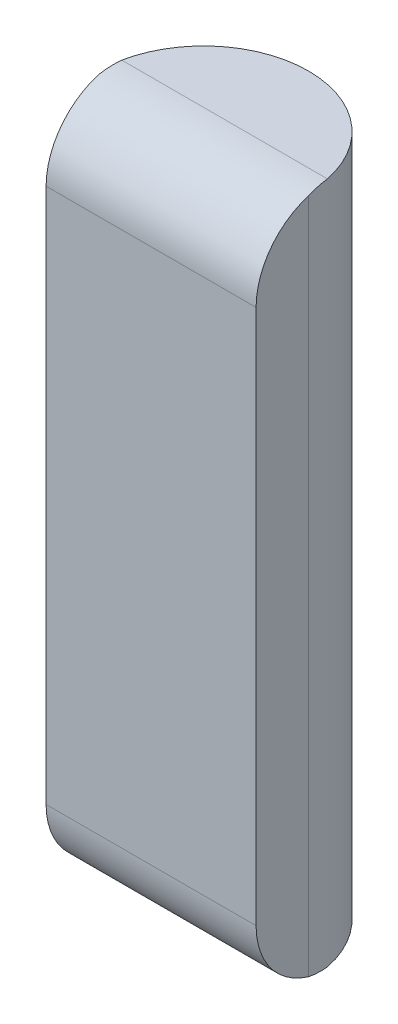
ISO-10303-21;
HEADER;
FILE_DESCRIPTION(('STEP AP214'),'2;1');
FILE_NAME('part.step','',(''),(''),'','','');
FILE_SCHEMA(('AUTOMOTIVE_DESIGN { 1 0 10303 214 1 1 1 1 }'));
ENDSEC;
DATA;
#1=APPLICATION_CONTEXT('core data for automotive mechanical design processes');
#2=APPLICATION_PROTOCOL_DEFINITION('international standard','automotive_design',2000,#1);
#3=PRODUCT_CONTEXT('',#1,'mechanical');
#4=PRODUCT('Part','Part','',(#3));
#5=PRODUCT_RELATED_PRODUCT_CATEGORY('part','',(#4));
#6=PRODUCT_DEFINITION_FORMATION('','',#4);
#7=PRODUCT_DEFINITION_CONTEXT('part definition',#1,'design');
#8=PRODUCT_DEFINITION('design','',#6,#7);
#9=PRODUCT_DEFINITION_SHAPE('','',#8);
#10=(LENGTH_UNIT() NAMED_UNIT(*) SI_UNIT(.MILLI.,.METRE.));
#11=(NAMED_UNIT(*) PLANE_ANGLE_UNIT() SI_UNIT($,.RADIAN.));
#12=(NAMED_UNIT(*) SI_UNIT($,.STERADIAN.) SOLID_ANGLE_UNIT());
#13=UNCERTAINTY_MEASURE_WITH_UNIT(LENGTH_MEASURE(1.E-05),#10,'distance_accuracy_value','');
#14=(GEOMETRIC_REPRESENTATION_CONTEXT(3) GLOBAL_UNCERTAINTY_ASSIGNED_CONTEXT((#13)) GLOBAL_UNIT_ASSIGNED_CONTEXT((#10,
#11,#12)) REPRESENTATION_CONTEXT('',''));
#15=CARTESIAN_POINT('',(0.,0.,0.));
#16=DIRECTION('',(0.,0.,1.));
#17=DIRECTION('',(1.,0.,0.));
#18=AXIS2_PLACEMENT_3D('',#15,#16,#17);
#19=CARTESIAN_POINT('',(0.6,0.,0.35));
#20=DIRECTION('',(0.,1.,0.));
#21=DIRECTION('',(0.,0.,-1.));
#22=AXIS2_PLACEMENT_3D('',#19,#20,#21);
#23=CYLINDRICAL_SURFACE('',#22,0.1);
#24=CARTESIAN_POINT('',(0.700000000000001,0.647082039324995,0.349999999999997));
#25=CARTESIAN_POINT('',(0.699915816237973,0.647323506050398,0.349190121189793));
#26=CARTESIAN_POINT('',(0.699831632475945,0.647550292569989,0.348375866058584));
#27=CARTESIAN_POINT('',(0.699663264951889,0.647974238368766,0.34673967912913));
#28=CARTESIAN_POINT('',(0.699579081189861,0.648171397647952,0.345917747330885));
#29=CARTESIAN_POINT('',(0.699410713665805,0.648535822137135,0.344267283042332));
#30=CARTESIAN_POINT('',(0.699326529903777,0.648703087347132,0.343438750552023));
#31=CARTESIAN_POINT('',(0.699158162379721,0.649007506544538,0.341776172212152));
#32=CARTESIAN_POINT('',(0.699073978617693,0.649144660531946,0.340942126362589));
#33=CARTESIAN_POINT('',(0.698905611093636,0.649388676630988,0.339269615138349));
#34=CARTESIAN_POINT('',(0.698821427331608,0.649495538742622,0.338431149763672));
#35=CARTESIAN_POINT('',(0.698653059807552,0.649678831688704,0.336750899341898));
#36=CARTESIAN_POINT('',(0.698568876045524,0.649755262523153,0.3359091142948));
#37=CARTESIAN_POINT('',(0.698400508521468,0.649877590349677,0.334223328579187));
#38=CARTESIAN_POINT('',(0.69831632475944,0.649923487341753,0.333379327910672));
#39=CARTESIAN_POINT('',(0.698147957235384,0.649984695768093,0.331690218311812));
#40=CARTESIAN_POINT('',(0.698063773473356,0.650000007202358,0.330845109381467));
#41=CARTESIAN_POINT('',(0.697979589711328,0.65,0.33));
#42=B_SPLINE_CURVE_WITH_KNOTS('',3,(#24,#25,#26,#27,#28,#29,#30,#31,#32,#33,#34,#35,#36,#37,#38,
#39,#40,#41),.UNSPECIFIED.,.F.,.F.,(4,2,2,2,2,2,2,2,4),(0.,0.0025477371259426,
0.0050954742518852,0.00764321137782769,0.0101909485037703,0.0127386856297129,0.0152864227556555,
0.0178341598815981,0.0203818970075407),.UNSPECIFIED.);
#43=CARTESIAN_POINT('',(0.700000000000001,0.647082039324994,0.35));
#44=VERTEX_POINT('',#43);
#45=CARTESIAN_POINT('',(0.697979589711328,0.65,0.33));
#46=VERTEX_POINT('',#45);
#47=EDGE_CURVE('E11',#44,#46,#42,.T.);
#48=ORIENTED_EDGE('',*,*,#47,.F.);
#49=DIRECTION('',(0.,1.,0.));
#50=VECTOR('',#49,1.);
#51=CARTESIAN_POINT('',(0.700000000000001,0.,0.35));
#52=LINE('',#51,#50);
#53=CARTESIAN_POINT('',(0.700000000000001,0.00291796067500627,0.35));
#54=VERTEX_POINT('',#53);
#55=EDGE_CURVE('E25',#54,#44,#52,.T.);
#56=ORIENTED_EDGE('',*,*,#55,.F.);
#57=CARTESIAN_POINT('',(0.697979589711328,0.,0.33));
#58=CARTESIAN_POINT('',(0.698063773473356,-7.20235840353421E-09,0.330845109381467));
#59=CARTESIAN_POINT('',(0.698147957235384,1.53042319068309E-05,0.331690218311812));
#60=CARTESIAN_POINT('',(0.69831632475944,7.65126582475088E-05,0.333379327910672));
#61=CARTESIAN_POINT('',(0.698400508521468,0.000122409650322953,0.334223328579187));
#62=CARTESIAN_POINT('',(0.698568876045524,0.000244737476846982,0.3359091142948));
#63=CARTESIAN_POINT('',(0.698653059807552,0.000321168311295568,0.336750899341898));
#64=CARTESIAN_POINT('',(0.698821427331608,0.000504461257378027,0.338431149763672));
#65=CARTESIAN_POINT('',(0.698905611093636,0.000611323369011901,0.339269615138349));
#66=CARTESIAN_POINT('',(0.699073978617693,0.000855339468053784,0.340942126362589));
#67=CARTESIAN_POINT('',(0.699158162379721,0.000992493455461792,0.341776172212152));
#68=CARTESIAN_POINT('',(0.699326529903777,0.00129691265286743,0.343438750552023));
#69=CARTESIAN_POINT('',(0.699410713665805,0.00146417786286507,0.344267283042332));
#70=CARTESIAN_POINT('',(0.699579081189861,0.00182860235204831,0.345917747330885));
#71=CARTESIAN_POINT('',(0.699663264951889,0.0020257616312339,0.34673967912913));
#72=CARTESIAN_POINT('',(0.699831632475945,0.00244970743001087,0.348375866058584));
#73=CARTESIAN_POINT('',(0.699915816237973,0.00267649394960225,0.349190121189793));
#74=CARTESIAN_POINT('',(0.700000000000001,0.00291796067500541,0.349999999999997));
#75=B_SPLINE_CURVE_WITH_KNOTS('',3,(#57,#58,#59,#60,#61,#62,#63,#64,#65,#66,#67,#68,#69,#70,#71,
#72,#73,#74),.UNSPECIFIED.,.F.,.F.,(4,2,2,2,2,2,2,2,4),(0.,0.00254773712594261,
0.00509547425188525,0.00764321137782786,0.0101909485037705,0.012738685629713,0.0152864227556557,
0.0178341598815982,0.0203818970075408),.UNSPECIFIED.);
#76=CARTESIAN_POINT('',(0.697979589711328,0.,0.33));
#77=VERTEX_POINT('',#76);
#78=EDGE_CURVE('E171',#77,#54,#75,.T.);
#79=ORIENTED_EDGE('',*,*,#78,.F.);
#80=CARTESIAN_POINT('',(0.6,0.,0.35));
#81=DIRECTION('',(0.,1.,0.));
#82=DIRECTION('',(0.,0.,1.));
#83=AXIS2_PLACEMENT_3D('',#80,#81,#82);
#84=CIRCLE('',#83,0.1);
#85=CARTESIAN_POINT('',(0.502020410288673,0.,0.33));
#86=VERTEX_POINT('',#85);
#87=EDGE_CURVE('E206',#77,#86,#84,.T.);
#88=ORIENTED_EDGE('',*,*,#87,.T.);
#89=CARTESIAN_POINT('',(0.5,0.00291796067500539,0.349999999999997));
#90=CARTESIAN_POINT('',(0.500084183762028,0.00267649394960223,0.349190121189793));
#91=CARTESIAN_POINT('',(0.500168367524056,0.00244970743001086,0.348375866058584));
#92=CARTESIAN_POINT('',(0.500336735048112,0.00202576163123388,0.34673967912913));
#93=CARTESIAN_POINT('',(0.50042091881014,0.00182860235204828,0.345917747330885));
#94=CARTESIAN_POINT('',(0.500589286334196,0.00146417786286505,0.344267283042332));
#95=CARTESIAN_POINT('',(0.500673470096224,0.00129691265286742,0.343438750552023));
#96=CARTESIAN_POINT('',(0.50084183762028,0.000992493455461778,0.341776172212152));
#97=CARTESIAN_POINT('',(0.500926021382308,0.000855339468053773,0.340942126362589));
#98=CARTESIAN_POINT('',(0.501094388906365,0.000611323369011889,0.339269615138349));
#99=CARTESIAN_POINT('',(0.501178572668392,0.00050446125737801,0.338431149763672));
#100=CARTESIAN_POINT('',(0.501346940192449,0.000321168311295555,0.336750899341898));
#101=CARTESIAN_POINT('',(0.501431123954477,0.000244737476846979,0.3359091142948));
#102=CARTESIAN_POINT('',(0.501599491478533,0.000122409650322957,0.334223328579187));
#103=CARTESIAN_POINT('',(0.501683675240561,7.6512658247511E-05,0.333379327910672));
#104=CARTESIAN_POINT('',(0.501852042764617,1.5304231906828E-05,0.331690218311812));
#105=CARTESIAN_POINT('',(0.501936226526645,-7.20235840859029E-09,0.330845109381467));
#106=CARTESIAN_POINT('',(0.502020410288673,0.,0.33));
#107=B_SPLINE_CURVE_WITH_KNOTS('',3,(#89,#90,#91,#92,#93,#94,#95,#96,#97,#98,#99,#100,#101,#102,
#103,#104,#105,#106),.UNSPECIFIED.,.F.,.F.,(4,2,2,2,2,2,2,2,4),(0.,0.00254773712594259,
0.00509547425188521,0.00764321137782782,0.0101909485037704,0.012738685629713,0.0152864227556556,
0.0178341598815982,0.0203818970075408),.UNSPECIFIED.);
#108=CARTESIAN_POINT('',(0.5,0.00291796067500622,0.35));
#109=VERTEX_POINT('',#108);
#110=EDGE_CURVE('E203',#109,#86,#107,.T.);
#111=ORIENTED_EDGE('',*,*,#110,.F.);
#112=DIRECTION('',(0.,1.,0.));
#113=VECTOR('',#112,1.);
#114=CARTESIAN_POINT('',(0.5,0.,0.35));
#115=LINE('',#114,#113);
#116=CARTESIAN_POINT('',(0.5,0.647082039324994,0.35));
#117=VERTEX_POINT('',#116);
#118=EDGE_CURVE('E75',#109,#117,#115,.T.);
#119=ORIENTED_EDGE('',*,*,#118,.T.);
#120=CARTESIAN_POINT('',(0.502020410288673,0.65,0.33));
#121=CARTESIAN_POINT('',(0.501936226526645,0.650000007202358,0.330845109381467));
#122=CARTESIAN_POINT('',(0.501852042764617,0.649984695768093,0.331690218311812));
#123=CARTESIAN_POINT('',(0.501683675240561,0.649923487341753,0.333379327910672));
#124=CARTESIAN_POINT('',(0.501599491478533,0.649877590349677,0.334223328579187));
#125=CARTESIAN_POINT('',(0.501431123954477,0.649755262523153,0.3359091142948));
#126=CARTESIAN_POINT('',(0.501346940192449,0.649678831688704,0.336750899341897));
#127=CARTESIAN_POINT('',(0.501178572668392,0.649495538742622,0.338431149763672));
#128=CARTESIAN_POINT('',(0.501094388906365,0.649388676630988,0.339269615138349));
#129=CARTESIAN_POINT('',(0.500926021382308,0.649144660531946,0.340942126362589));
#130=CARTESIAN_POINT('',(0.50084183762028,0.649007506544538,0.341776172212152));
#131=CARTESIAN_POINT('',(0.500673470096224,0.648703087347132,0.343438750552023));
#132=CARTESIAN_POINT('',(0.500589286334196,0.648535822137135,0.344267283042332));
#133=CARTESIAN_POINT('',(0.50042091881014,0.648171397647952,0.345917747330885));
#134=CARTESIAN_POINT('',(0.500336735048112,0.647974238368766,0.34673967912913));
#135=CARTESIAN_POINT('',(0.500168367524056,0.647550292569989,0.348375866058584));
#136=CARTESIAN_POINT('',(0.500084183762028,0.647323506050398,0.349190121189793));
#137=CARTESIAN_POINT('',(0.5,0.647082039324995,0.349999999999997));
#138=B_SPLINE_CURVE_WITH_KNOTS('',3,(#120,#121,#122,#123,#124,#125,#126,#127,#128,#129,#130,
#131,#132,#133,#134,#135,#136,#137),.UNSPECIFIED.,.F.,.F.,(4,2,2,2,2,2,2,2,4),(0.,
0.00254773712594256,0.00509547425188514,0.00764321137782775,0.0101909485037703,
0.0127386856297129,0.0152864227556555,0.0178341598815981,0.0203818970075407),.UNSPECIFIED.);
#139=CARTESIAN_POINT('',(0.502020410288673,0.65,0.33));
#140=VERTEX_POINT('',#139);
#141=EDGE_CURVE('E125',#140,#117,#138,.T.);
#142=ORIENTED_EDGE('',*,*,#141,.F.);
#143=CARTESIAN_POINT('',(0.6,0.65,0.35));
#144=DIRECTION('',(0.,1.,0.));
#145=DIRECTION('',(0.,0.,1.));
#146=AXIS2_PLACEMENT_3D('',#143,#144,#145);
#147=CIRCLE('',#146,0.1);
#148=EDGE_CURVE('E120',#46,#140,#147,.T.);
#149=ORIENTED_EDGE('',*,*,#148,.F.);
#150=EDGE_LOOP('',(#48,#56,#79,#88,#111,#119,#142,#149));
#151=FACE_BOUND('',#150,.T.);
#152=ADVANCED_FACE('F17',(#151),#23,.T.);
#153=CARTESIAN_POINT('',(0.700000000000001,0.,0.35));
#154=DIRECTION('',(1.,0.,0.));
#155=DIRECTION('',(0.,0.,-1.));
#156=AXIS2_PLACEMENT_3D('',#153,#154,#155);
#157=PLANE('',#156);
#158=CARTESIAN_POINT('',(0.700000000000001,0.58,0.33));
#159=DIRECTION('',(-1.,0.,0.));
#160=DIRECTION('',(0.,0.,-1.));
#161=AXIS2_PLACEMENT_3D('',#158,#159,#160);
#162=CIRCLE('',#161,0.07);
#163=CARTESIAN_POINT('',(0.700000000000001,0.58,0.4));
#164=VERTEX_POINT('',#163);
#165=EDGE_CURVE('E116',#164,#44,#162,.T.);
#166=ORIENTED_EDGE('',*,*,#165,.F.);
#167=DIRECTION('',(0.,-1.,0.));
#168=VECTOR('',#167,1.);
#169=CARTESIAN_POINT('',(0.7,0.65,0.4));
#170=LINE('',#169,#168);
#171=CARTESIAN_POINT('',(0.700000000000001,0.07,0.4));
#172=VERTEX_POINT('',#171);
#173=EDGE_CURVE('E114',#164,#172,#170,.T.);
#174=ORIENTED_EDGE('',*,*,#173,.T.);
#175=CARTESIAN_POINT('',(0.700000000000001,0.07,0.33));
#176=DIRECTION('',(-1.,0.,0.));
#177=DIRECTION('',(0.,0.,-1.));
#178=AXIS2_PLACEMENT_3D('',#175,#176,#177);
#179=CIRCLE('',#178,0.07);
#180=EDGE_CURVE('E94',#54,#172,#179,.T.);
#181=ORIENTED_EDGE('',*,*,#180,.F.);
#182=ORIENTED_EDGE('',*,*,#55,.T.);
#183=EDGE_LOOP('',(#166,#174,#181,#182));
#184=FACE_BOUND('',#183,.T.);
#185=ADVANCED_FACE('F226',(#184),#157,.T.);
#186=CARTESIAN_POINT('',(0.5,0.,0.4));
#187=DIRECTION('',(-1.,0.,0.));
#188=DIRECTION('',(0.,0.,1.));
#189=AXIS2_PLACEMENT_3D('',#186,#187,#188);
#190=PLANE('',#189);
#191=CARTESIAN_POINT('',(0.5,0.58,0.33));
#192=DIRECTION('',(1.,0.,0.));
#193=DIRECTION('',(0.,0.,1.));
#194=AXIS2_PLACEMENT_3D('',#191,#192,#193);
#195=CIRCLE('',#194,0.07);
#196=CARTESIAN_POINT('',(0.5,0.58,0.4));
#197=VERTEX_POINT('',#196);
#198=EDGE_CURVE('E79',#117,#197,#195,.T.);
#199=ORIENTED_EDGE('',*,*,#198,.F.);
#200=ORIENTED_EDGE('',*,*,#118,.F.);
#201=CARTESIAN_POINT('',(0.5,0.07,0.33));
#202=DIRECTION('',(1.,0.,0.));
#203=DIRECTION('',(0.,0.,1.));
#204=AXIS2_PLACEMENT_3D('',#201,#202,#203);
#205=CIRCLE('',#204,0.07);
#206=CARTESIAN_POINT('',(0.5,0.07,0.4));
#207=VERTEX_POINT('',#206);
#208=EDGE_CURVE('E69',#207,#109,#205,.T.);
#209=ORIENTED_EDGE('',*,*,#208,.F.);
#210=DIRECTION('',(0.,1.,0.));
#211=VECTOR('',#210,1.);
#212=CARTESIAN_POINT('',(0.5,0.,0.4));
#213=LINE('',#212,#211);
#214=EDGE_CURVE('E73',#207,#197,#213,.T.);
#215=ORIENTED_EDGE('',*,*,#214,.T.);
#216=EDGE_LOOP('',(#199,#200,#209,#215));
#217=FACE_BOUND('',#216,.T.);
#218=ADVANCED_FACE('F72',(#217),#190,.T.);
#219=CARTESIAN_POINT('',(0.,0.58,0.33));
#220=DIRECTION('',(-1.,0.,0.));
#221=DIRECTION('',(0.,0.,1.));
#222=AXIS2_PLACEMENT_3D('',#219,#220,#221);
#223=CYLINDRICAL_SURFACE('',#222,0.07);
#224=DIRECTION('',(1.,0.,0.));
#225=VECTOR('',#224,1.);
#226=CARTESIAN_POINT('',(0.8,0.65,0.33));
#227=LINE('',#226,#225);
#228=EDGE_CURVE('E88',#140,#46,#227,.T.);
#229=ORIENTED_EDGE('',*,*,#228,.F.);
#230=ORIENTED_EDGE('',*,*,#141,.T.);
#231=ORIENTED_EDGE('',*,*,#198,.T.);
#232=DIRECTION('',(-1.,0.,0.));
#233=VECTOR('',#232,1.);
#234=CARTESIAN_POINT('',(-0.8,0.58,0.4));
#235=LINE('',#234,#233);
#236=EDGE_CURVE('E87',#164,#197,#235,.T.);
#237=ORIENTED_EDGE('',*,*,#236,.F.);
#238=ORIENTED_EDGE('',*,*,#165,.T.);
#239=ORIENTED_EDGE('',*,*,#47,.T.);
#240=EDGE_LOOP('',(#229,#230,#231,#237,#238,#239));
#241=FACE_BOUND('',#240,.T.);
#242=ADVANCED_FACE('F141',(#241),#223,.T.);
#243=CARTESIAN_POINT('',(0.,0.65,0.));
#244=DIRECTION('',(0.,1.,0.));
#245=DIRECTION('',(0.,0.,1.));
#246=AXIS2_PLACEMENT_3D('',#243,#244,#245);
#247=PLANE('',#246);
#248=ORIENTED_EDGE('',*,*,#228,.T.);
#249=ORIENTED_EDGE('',*,*,#148,.T.);
#250=EDGE_LOOP('',(#248,#249));
#251=FACE_BOUND('',#250,.T.);
#252=ADVANCED_FACE('F151',(#251),#247,.T.);
#253=CARTESIAN_POINT('',(0.8,0.65,0.4));
#254=DIRECTION('',(0.,0.,-1.));
#255=DIRECTION('',(-1.,0.,0.));
#256=AXIS2_PLACEMENT_3D('',#253,#254,#255);
#257=PLANE('',#256);
#258=ORIENTED_EDGE('',*,*,#214,.F.);
#259=DIRECTION('',(1.,0.,0.));
#260=VECTOR('',#259,1.);
#261=CARTESIAN_POINT('',(0.8,0.07,0.4));
#262=LINE('',#261,#260);
#263=EDGE_CURVE('E85',#207,#172,#262,.T.);
#264=ORIENTED_EDGE('',*,*,#263,.T.);
#265=ORIENTED_EDGE('',*,*,#173,.F.);
#266=ORIENTED_EDGE('',*,*,#236,.T.);
#267=EDGE_LOOP('',(#258,#264,#265,#266));
#268=FACE_BOUND('',#267,.T.);
#269=ADVANCED_FACE('F83',(#268),#257,.F.);
#270=CARTESIAN_POINT('',(0.8,0.07,0.33));
#271=DIRECTION('',(1.,0.,0.));
#272=DIRECTION('',(0.,0.,-1.));
#273=AXIS2_PLACEMENT_3D('',#270,#271,#272);
#274=CYLINDRICAL_SURFACE('',#273,0.07);
#275=ORIENTED_EDGE('',*,*,#208,.T.);
#276=ORIENTED_EDGE('',*,*,#110,.T.);
#277=DIRECTION('',(-1.,0.,0.));
#278=VECTOR('',#277,1.);
#279=CARTESIAN_POINT('',(0.,0.,0.33));
#280=LINE('',#279,#278);
#281=EDGE_CURVE('E95',#77,#86,#280,.T.);
#282=ORIENTED_EDGE('',*,*,#281,.F.);
#283=ORIENTED_EDGE('',*,*,#78,.T.);
#284=ORIENTED_EDGE('',*,*,#180,.T.);
#285=ORIENTED_EDGE('',*,*,#263,.F.);
#286=EDGE_LOOP('',(#275,#276,#282,#283,#284,#285));
#287=FACE_BOUND('',#286,.T.);
#288=ADVANCED_FACE('F91',(#287),#274,.T.);
#289=CARTESIAN_POINT('',(0.,0.,0.));
#290=DIRECTION('',(0.,1.,0.));
#291=DIRECTION('',(0.,0.,1.));
#292=AXIS2_PLACEMENT_3D('',#289,#290,#291);
#293=PLANE('',#292);
#294=ORIENTED_EDGE('',*,*,#87,.F.);
#295=ORIENTED_EDGE('',*,*,#281,.T.);
#296=EDGE_LOOP('',(#294,#295));
#297=FACE_BOUND('',#296,.T.);
#298=ADVANCED_FACE('F189',(#297),#293,.F.);
#299=CLOSED_SHELL('',(#152,#185,#218,#242,#252,#269,#288,#298));
#300=MANIFOLD_SOLID_BREP('B1',#299);
#301=ADVANCED_BREP_SHAPE_REPRESENTATION('',(#18,#300),#14);
#302=SHAPE_DEFINITION_REPRESENTATION(#9,#301);
ENDSEC;
END-ISO-10303-21;
